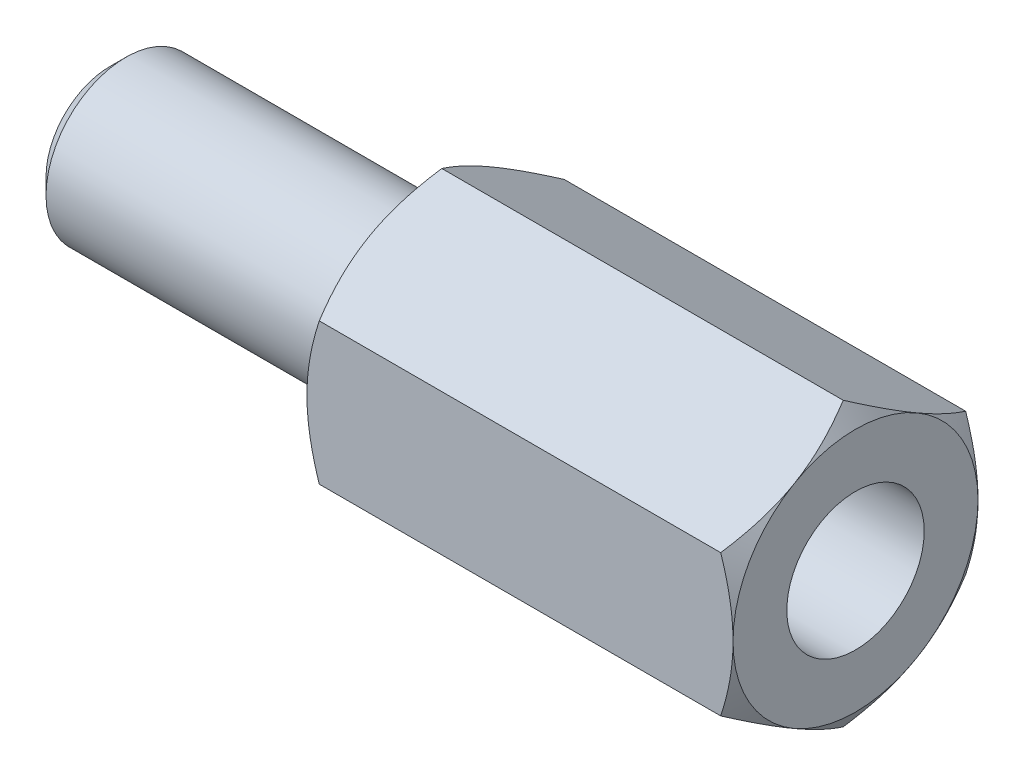
ISO-10303-21;
HEADER;
FILE_DESCRIPTION(('STEP AP214'),'2;1');
FILE_NAME('part.step','',(''),(''),'','','');
FILE_SCHEMA(('AUTOMOTIVE_DESIGN { 1 0 10303 214 1 1 1 1 }'));
ENDSEC;
DATA;
#1=APPLICATION_CONTEXT('core data for automotive mechanical design processes');
#2=APPLICATION_PROTOCOL_DEFINITION('international standard','automotive_design',2000,#1);
#3=PRODUCT_CONTEXT('',#1,'mechanical');
#4=PRODUCT('Part','Part','',(#3));
#5=PRODUCT_RELATED_PRODUCT_CATEGORY('part','',(#4));
#6=PRODUCT_DEFINITION_FORMATION('','',#4);
#7=PRODUCT_DEFINITION_CONTEXT('part definition',#1,'design');
#8=PRODUCT_DEFINITION('design','',#6,#7);
#9=PRODUCT_DEFINITION_SHAPE('','',#8);
#10=(LENGTH_UNIT() NAMED_UNIT(*) SI_UNIT(.MILLI.,.METRE.));
#11=(NAMED_UNIT(*) PLANE_ANGLE_UNIT() SI_UNIT($,.RADIAN.));
#12=(NAMED_UNIT(*) SI_UNIT($,.STERADIAN.) SOLID_ANGLE_UNIT());
#13=UNCERTAINTY_MEASURE_WITH_UNIT(LENGTH_MEASURE(1.E-05),#10,'distance_accuracy_value','');
#14=(GEOMETRIC_REPRESENTATION_CONTEXT(3) GLOBAL_UNCERTAINTY_ASSIGNED_CONTEXT((#13)) GLOBAL_UNIT_ASSIGNED_CONTEXT((#10,
#11,#12)) REPRESENTATION_CONTEXT('',''));
#15=CARTESIAN_POINT('',(0.,0.,0.));
#16=DIRECTION('',(0.,0.,1.));
#17=DIRECTION('',(1.,0.,0.));
#18=AXIS2_PLACEMENT_3D('',#15,#16,#17);
#19=CARTESIAN_POINT('',(14.,1.32790561913614,-2.3));
#20=DIRECTION('',(0.,-0.866025403784439,0.5));
#21=DIRECTION('',(0.,-0.5,-0.866025403784439));
#22=AXIS2_PLACEMENT_3D('',#19,#20,#21);
#23=PLANE('',#22);
#24=CARTESIAN_POINT('',(6.23114151189903,2.65592670832612,0.00019999999999939));
#25=CARTESIAN_POINT('',(6.19280529166582,2.59691366397619,-0.102013591123392));
#26=CARTESIAN_POINT('',(6.15788766232366,2.53725620375695,-0.205343343273629));
#27=CARTESIAN_POINT('',(6.09699087829287,2.41662067178499,-0.414290213847163));
#28=CARTESIAN_POINT('',(6.0710407846175,2.35563897469395,-0.519913611540628));
#29=CARTESIAN_POINT('',(6.03109182721771,2.23463330972118,-0.72950157127711));
#30=CARTESIAN_POINT('',(6.01674344849799,2.17463934796522,-0.833414161185785));
#31=CARTESIAN_POINT('',(6.00019012206238,2.05431916024773,-1.04181483948871));
#32=CARTESIAN_POINT('',(5.99796500163448,1.99399365354472,-1.14630168209065));
#33=CARTESIAN_POINT('',(6.00522880175094,1.88294362999616,-1.33864596505849));
#34=CARTESIAN_POINT('',(6.01294684621271,1.83218746528761,-1.42655822113102));
#35=CARTESIAN_POINT('',(6.0365520344793,1.73109854203754,-1.60164937228258));
#36=CARTESIAN_POINT('',(6.05244893047322,1.68076636202344,-1.6888272653227));
#37=CARTESIAN_POINT('',(6.09186773641299,1.5794360509366,-1.86433651247186));
#38=CARTESIAN_POINT('',(6.11558727119428,1.52845765714816,-1.9526336806017));
#39=CARTESIAN_POINT('',(6.16912455996599,1.42743944967399,-2.12760234843648));
#40=CARTESIAN_POINT('',(6.19892672049603,1.37739758625026,-2.21427739839182));
#41=CARTESIAN_POINT('',(6.23114151189903,1.3277901490823,-2.3002));
#42=B_SPLINE_CURVE_WITH_KNOTS('',3,(#24,#25,#26,#27,#28,#29,#30,#31,#32,#33,#34,#35,#36,#37,#38,
#39,#40,#41),.UNSPECIFIED.,.F.,.F.,(4,2,2,2,2,2,2,2,4),(0.,0.372495415358142,0.746186895291046,
1.10815054025611,1.46951170498925,1.77457803763789,2.08000896710876,2.39383739121041,
2.70687116627133),.UNSPECIFIED.);
#43=CARTESIAN_POINT('',(6.23106651987903,2.65581123827228,0.));
#44=VERTEX_POINT('',#43);
#45=CARTESIAN_POINT('',(6.,1.99185842870421,-1.15));
#46=VERTEX_POINT('',#45);
#47=EDGE_CURVE('E57',#44,#46,#42,.T.);
#48=ORIENTED_EDGE('',*,*,#47,.F.);
#49=DIRECTION('',(-1.,0.,0.));
#50=VECTOR('',#49,1.);
#51=CARTESIAN_POINT('',(14.,2.65581123827228,0.));
#52=LINE('',#51,#50);
#53=CARTESIAN_POINT('',(13.768933480121,2.65581123827228,0.));
#54=VERTEX_POINT('',#53);
#55=EDGE_CURVE('E185',#54,#44,#52,.T.);
#56=ORIENTED_EDGE('',*,*,#55,.F.);
#57=CARTESIAN_POINT('',(13.768858488101,1.3277901490823,-2.3002));
#58=CARTESIAN_POINT('',(13.8071947083342,1.38680319343223,-2.19798640887661));
#59=CARTESIAN_POINT('',(13.8421123376763,1.44646065365147,-2.09465665672637));
#60=CARTESIAN_POINT('',(13.9030091217071,1.56709618562343,-1.88570978615284));
#61=CARTESIAN_POINT('',(13.9289592153825,1.62807788271447,-1.78008638845937));
#62=CARTESIAN_POINT('',(13.9689081727823,1.74908354768723,-1.57049842872289));
#63=CARTESIAN_POINT('',(13.983256551502,1.8090775094432,-1.46658583881422));
#64=CARTESIAN_POINT('',(13.9998098779376,1.92939769716069,-1.25818516051129));
#65=CARTESIAN_POINT('',(14.0020349983655,1.9897232038637,-1.15369831790935));
#66=CARTESIAN_POINT('',(13.9947711982491,2.10077322741226,-0.961354034941513));
#67=CARTESIAN_POINT('',(13.9870531537873,2.15152939212081,-0.873441778868978));
#68=CARTESIAN_POINT('',(13.9634479655207,2.25261831537088,-0.698350627717423));
#69=CARTESIAN_POINT('',(13.9475510695268,2.30295049538498,-0.611172734677299));
#70=CARTESIAN_POINT('',(13.908132263587,2.40428080647181,-0.435663487528143));
#71=CARTESIAN_POINT('',(13.8844127288057,2.45525920026026,-0.347366319398302));
#72=CARTESIAN_POINT('',(13.830875440034,2.55627740773442,-0.172397651563515));
#73=CARTESIAN_POINT('',(13.801073279504,2.60631927115816,-0.0857226016081787));
#74=CARTESIAN_POINT('',(13.768858488101,2.65592670832612,0.000199999999999665));
#75=B_SPLINE_CURVE_WITH_KNOTS('',3,(#57,#58,#59,#60,#61,#62,#63,#64,#65,#66,#67,#68,#69,#70,#71,
#72,#73,#74),.UNSPECIFIED.,.F.,.F.,(4,2,2,2,2,2,2,2,4),(0.,0.372495415358142,0.746186895291045,
1.10815054025611,1.46951170498925,1.77457803763789,2.08000896710876,2.39383739121041,
2.70687116627133),.UNSPECIFIED.);
#76=CARTESIAN_POINT('',(14.,1.99185842870421,-1.15));
#77=VERTEX_POINT('',#76);
#78=EDGE_CURVE('E305',#77,#54,#75,.T.);
#79=ORIENTED_EDGE('',*,*,#78,.F.);
#80=CARTESIAN_POINT('',(13.768933480121,1.32790561913614,-2.3));
#81=VERTEX_POINT('',#80);
#82=EDGE_CURVE('E419',#81,#77,#75,.T.);
#83=ORIENTED_EDGE('',*,*,#82,.F.);
#84=DIRECTION('',(-1.,0.,0.));
#85=VECTOR('',#84,1.);
#86=CARTESIAN_POINT('',(14.,1.32790561913614,-2.3));
#87=LINE('',#86,#85);
#88=CARTESIAN_POINT('',(6.23106651987903,1.32790561913614,-2.3));
#89=VERTEX_POINT('',#88);
#90=EDGE_CURVE('E166',#81,#89,#87,.T.);
#91=ORIENTED_EDGE('',*,*,#90,.T.);
#92=EDGE_CURVE('E157',#46,#89,#42,.T.);
#93=ORIENTED_EDGE('',*,*,#92,.F.);
#94=EDGE_LOOP('',(#48,#56,#79,#83,#91,#93));
#95=FACE_BOUND('',#94,.T.);
#96=ADVANCED_FACE('F40',(#95),#23,.F.);
#97=CARTESIAN_POINT('',(14.,2.65581123827228,0.));
#98=DIRECTION('',(0.,-0.866025403784439,-0.5));
#99=DIRECTION('',(0.,0.5,-0.866025403784439));
#100=AXIS2_PLACEMENT_3D('',#97,#98,#99);
#101=PLANE('',#100);
#102=CARTESIAN_POINT('',(6.23114151189903,1.3277901490823,2.3002));
#103=CARTESIAN_POINT('',(6.19280529166582,1.38680319343223,2.19798640887661));
#104=CARTESIAN_POINT('',(6.15788766232366,1.44646065365147,2.09465665672637));
#105=CARTESIAN_POINT('',(6.09699087829286,1.56709618562343,1.88570978615284));
#106=CARTESIAN_POINT('',(6.0710407846175,1.62807788271447,1.78008638845937));
#107=CARTESIAN_POINT('',(6.03109182721771,1.74908354768723,1.57049842872289));
#108=CARTESIAN_POINT('',(6.01674344849799,1.8090775094432,1.46658583881422));
#109=CARTESIAN_POINT('',(6.00019012206237,1.92939769716069,1.25818516051129));
#110=CARTESIAN_POINT('',(5.99796500163448,1.9897232038637,1.15369831790935));
#111=CARTESIAN_POINT('',(6.00522880175094,2.10077322741226,0.961354034941513));
#112=CARTESIAN_POINT('',(6.01294684621271,2.15152939212081,0.873441778868978));
#113=CARTESIAN_POINT('',(6.0365520344793,2.25261831537088,0.698350627717423));
#114=CARTESIAN_POINT('',(6.05244893047322,2.30295049538498,0.611172734677299));
#115=CARTESIAN_POINT('',(6.09186773641299,2.40428080647181,0.435663487528143));
#116=CARTESIAN_POINT('',(6.11558727119428,2.45525920026026,0.347366319398302));
#117=CARTESIAN_POINT('',(6.16912455996599,2.55627740773442,0.172397651563515));
#118=CARTESIAN_POINT('',(6.19892672049603,2.60631927115816,0.0857226016081783));
#119=CARTESIAN_POINT('',(6.23114151189903,2.65592670832612,-0.0002000000000004));
#120=B_SPLINE_CURVE_WITH_KNOTS('',3,(#102,#103,#104,#105,#106,#107,#108,#109,#110,#111,#112,
#113,#114,#115,#116,#117,#118,#119),.UNSPECIFIED.,.F.,.F.,(4,2,2,2,2,2,2,2,4),(0.,
0.372495415358143,0.746186895291046,1.10815054025611,1.46951170498925,1.77457803763789,
2.08000896710876,2.39383739121041,2.70687116627134),.UNSPECIFIED.);
#121=CARTESIAN_POINT('',(6.23106651987903,1.32790561913614,2.3));
#122=VERTEX_POINT('',#121);
#123=CARTESIAN_POINT('',(6.,1.99185842870421,1.15));
#124=VERTEX_POINT('',#123);
#125=EDGE_CURVE('E64',#122,#124,#120,.T.);
#126=ORIENTED_EDGE('',*,*,#125,.F.);
#127=DIRECTION('',(-1.,0.,0.));
#128=VECTOR('',#127,1.);
#129=CARTESIAN_POINT('',(14.,1.32790561913614,2.3));
#130=LINE('',#129,#128);
#131=CARTESIAN_POINT('',(13.768933480121,1.32790561913614,2.3));
#132=VERTEX_POINT('',#131);
#133=EDGE_CURVE('E181',#132,#122,#130,.T.);
#134=ORIENTED_EDGE('',*,*,#133,.F.);
#135=CARTESIAN_POINT('',(13.768858488101,2.65592670832612,-0.000200000000000705));
#136=CARTESIAN_POINT('',(13.8071947083342,2.59691366397619,0.10201359112339));
#137=CARTESIAN_POINT('',(13.8421123376763,2.53725620375695,0.205343343273628));
#138=CARTESIAN_POINT('',(13.9030091217071,2.41662067178499,0.414290213847162));
#139=CARTESIAN_POINT('',(13.9289592153825,2.35563897469395,0.519913611540627));
#140=CARTESIAN_POINT('',(13.9689081727823,2.23463330972119,0.729501571277108));
#141=CARTESIAN_POINT('',(13.983256551502,2.17463934796522,0.833414161185783));
#142=CARTESIAN_POINT('',(13.9998098779376,2.05431916024773,1.04181483948871));
#143=CARTESIAN_POINT('',(14.0020349983655,1.99399365354472,1.14630168209065));
#144=CARTESIAN_POINT('',(13.9947711982491,1.88294362999616,1.33864596505849));
#145=CARTESIAN_POINT('',(13.9870531537873,1.83218746528761,1.42655822113102));
#146=CARTESIAN_POINT('',(13.9634479655207,1.73109854203754,1.60164937228258));
#147=CARTESIAN_POINT('',(13.9475510695268,1.68076636202344,1.6888272653227));
#148=CARTESIAN_POINT('',(13.908132263587,1.5794360509366,1.86433651247186));
#149=CARTESIAN_POINT('',(13.8844127288057,1.52845765714816,1.9526336806017));
#150=CARTESIAN_POINT('',(13.830875440034,1.42743944967399,2.12760234843648));
#151=CARTESIAN_POINT('',(13.801073279504,1.37739758625026,2.21427739839182));
#152=CARTESIAN_POINT('',(13.768858488101,1.3277901490823,2.3002));
#153=B_SPLINE_CURVE_WITH_KNOTS('',3,(#135,#136,#137,#138,#139,#140,#141,#142,#143,#144,#145,
#146,#147,#148,#149,#150,#151,#152),.UNSPECIFIED.,.F.,.F.,(4,2,2,2,2,2,2,2,4),(0.,
0.372495415358142,0.746186895291045,1.10815054025611,1.46951170498925,1.77457803763789,
2.08000896710876,2.39383739121041,2.70687116627134),.UNSPECIFIED.);
#154=CARTESIAN_POINT('',(14.,1.99185842870421,1.15));
#155=VERTEX_POINT('',#154);
#156=EDGE_CURVE('E296',#155,#132,#153,.T.);
#157=ORIENTED_EDGE('',*,*,#156,.F.);
#158=EDGE_CURVE('E303',#54,#155,#153,.T.);
#159=ORIENTED_EDGE('',*,*,#158,.F.);
#160=ORIENTED_EDGE('',*,*,#55,.T.);
#161=EDGE_CURVE('E322',#124,#44,#120,.T.);
#162=ORIENTED_EDGE('',*,*,#161,.F.);
#163=EDGE_LOOP('',(#126,#134,#157,#159,#160,#162));
#164=FACE_BOUND('',#163,.T.);
#165=ADVANCED_FACE('F312',(#164),#101,.F.);
#166=CARTESIAN_POINT('',(14.,1.32790561913614,2.3));
#167=DIRECTION('',(0.,0.,-1.));
#168=DIRECTION('',(-1.,0.,0.));
#169=AXIS2_PLACEMENT_3D('',#166,#167,#168);
#170=PLANE('',#169);
#171=CARTESIAN_POINT('',(7.18303327864269,-3.42030783160288,2.3));
#172=CARTESIAN_POINT('',(7.1321404948453,-3.32584338319353,2.3));
#173=CARTESIAN_POINT('',(7.08173425774497,-3.23111223233854,2.3));
#174=CARTESIAN_POINT('',(6.98216059123448,-3.04097999487793,2.3));
#175=CARTESIAN_POINT('',(6.93299338744914,-2.9455787902442,2.3));
#176=CARTESIAN_POINT('',(6.83588242210247,-2.75341096258753,2.3));
#177=CARTESIAN_POINT('',(6.78794811945419,-2.65663954283474,2.3));
#178=CARTESIAN_POINT('',(6.69401190604033,-2.46216658469587,2.3));
#179=CARTESIAN_POINT('',(6.6480098923948,-2.36446509616959,2.3));
#180=CARTESIAN_POINT('',(6.55676718158655,-2.16428050408746,2.3));
#181=CARTESIAN_POINT('',(6.51161895417136,-2.06175501956546,2.3));
#182=CARTESIAN_POINT('',(6.42468056875924,-1.8552646522458,2.3));
#183=CARTESIAN_POINT('',(6.38289083591838,-1.75129958915683,2.3));
#184=CARTESIAN_POINT('',(6.30375266900605,-1.54194750228997,2.3));
#185=CARTESIAN_POINT('',(6.26639429776416,-1.43656427364031,2.3));
#186=CARTESIAN_POINT('',(6.19728099263094,-1.22399350109623,2.3));
#187=CARTESIAN_POINT('',(6.16552408875659,-1.11680660611987,2.3));
#188=CARTESIAN_POINT('',(6.10778269918085,-0.895408884118111,2.3));
#189=CARTESIAN_POINT('',(6.08214346922818,-0.781106050706559,2.3));
#190=CARTESIAN_POINT('',(6.04054521215178,-0.550732196771112,2.3));
#191=CARTESIAN_POINT('',(6.02458395622617,-0.434661589675852,2.3));
#192=CARTESIAN_POINT('',(6.00400904827015,-0.203313901358985,2.3));
#193=CARTESIAN_POINT('',(5.99922219331011,-0.0880527049289574,2.3));
#194=CARTESIAN_POINT('',(6.00098619466147,0.14238765912966,2.3));
#195=CARTESIAN_POINT('',(6.00753818804377,0.257566817372611,2.3));
#196=CARTESIAN_POINT('',(6.03399455188254,0.512574782528764,2.3));
#197=CARTESIAN_POINT('',(6.05657021100428,0.652122213707216,2.3));
#198=CARTESIAN_POINT('',(6.11486053491366,0.928480071696349,2.3));
#199=CARTESIAN_POINT('',(6.15058789324207,1.06528771921453,2.3));
#200=CARTESIAN_POINT('',(6.21205384385533,1.26982039301699,2.3));
#201=CARTESIAN_POINT('',(6.23415895632612,1.33867848724306,2.3));
#202=CARTESIAN_POINT('',(6.28056657336378,1.47560987436602,2.3));
#203=CARTESIAN_POINT('',(6.3048678455193,1.5436835835458,2.3));
#204=CARTESIAN_POINT('',(6.35533733495519,1.67912527328069,2.3));
#205=CARTESIAN_POINT('',(6.38150542327363,1.74649330221703,2.3));
#206=CARTESIAN_POINT('',(6.43542964546163,1.8806004227156,2.3));
#207=CARTESIAN_POINT('',(6.46318601853407,1.94733941777032,2.3));
#208=CARTESIAN_POINT('',(6.53408452793011,2.11307507120337,2.3));
#209=CARTESIAN_POINT('',(6.57805286386828,2.2117180226973,2.3));
#210=CARTESIAN_POINT('',(6.66834555154003,2.40792267533292,2.3));
#211=CARTESIAN_POINT('',(6.71467011054109,2.50548428043035,2.3));
#212=CARTESIAN_POINT('',(6.85644286447474,2.79685928074956,2.3));
#213=CARTESIAN_POINT('',(6.95467053055366,2.98931832653304,2.3));
#214=CARTESIAN_POINT('',(7.15605309376747,3.37197876623115,2.3));
#215=CARTESIAN_POINT('',(7.25921518609194,3.56217632511064,2.3));
#216=CARTESIAN_POINT('',(7.46881762362887,3.94076432359893,2.3));
#217=CARTESIAN_POINT('',(7.57525814068571,4.1291546677983,2.3));
#218=CARTESIAN_POINT('',(7.78017756731166,4.48668897901717,2.3));
#219=CARTESIAN_POINT('',(7.87844668339502,4.65595367001293,2.3));
#220=CARTESIAN_POINT('',(8.07641128531736,4.99365625102697,2.3));
#221=CARTESIAN_POINT('',(8.17610683572957,5.16209410314856,2.3));
#222=CARTESIAN_POINT('',(8.37623148485575,5.4977267896045,2.3));
#223=CARTESIAN_POINT('',(8.47665675103161,5.66492391293493,2.3));
#224=CARTESIAN_POINT('',(8.67835916998006,5.99878717277001,2.3));
#225=CARTESIAN_POINT('',(8.77963626024932,6.16545334701733,2.3));
#226=CARTESIAN_POINT('',(8.88123264313394,6.33192315510402,2.3));
#227=B_SPLINE_CURVE_WITH_KNOTS('',3,(#171,#172,#173,#174,#175,#176,#177,#178,#179,#180,#181,
#182,#183,#184,#185,#186,#187,#188,#189,#190,#191,#192,#193,#194,#195,#196,#197,#198,#199,#200,
#201,#202,#203,#204,#205,#206,#207,#208,#209,#210,#211,#212,#213,#214,#215,#216,#217,#218,#219,
#220,#221,#222,#223,#224,#225,#226),.UNSPECIFIED.,.F.,.F.,(4,2,2,2,2,2,2,2,2,2,2,2,2,2,2,2,2,2,
2,2,2,2,2,2,2,2,2,4),(0.,0.321909015735127,0.643876232796546,0.967836762609239,1.29178002202603,
1.62781181071298,1.96388607130228,2.29919184899568,2.63437946667137,2.98546615740115,
3.33647196341553,3.68199998760644,4.02756266369631,4.45083371629972,4.874514370428,
5.09144326512395,5.30825117365043,5.52504411929786,5.74186980131834,6.06582201521799,
6.3898027753441,7.03791016082964,7.68699325507873,8.33611043025459,8.9232703672077,
9.5104569689248,10.0955704684849,10.6806414030129),.UNSPECIFIED.);
#228=CARTESIAN_POINT('',(6.23106651987903,-1.32790561913614,2.3));
#229=VERTEX_POINT('',#228);
#230=CARTESIAN_POINT('',(6.,0.,2.3));
#231=VERTEX_POINT('',#230);
#232=EDGE_CURVE('E342',#229,#231,#227,.T.);
#233=ORIENTED_EDGE('',*,*,#232,.F.);
#234=DIRECTION('',(-1.,0.,0.));
#235=VECTOR('',#234,1.);
#236=CARTESIAN_POINT('',(14.,-1.32790561913614,2.3));
#237=LINE('',#236,#235);
#238=CARTESIAN_POINT('',(13.768933480121,-1.32790561913614,2.3));
#239=VERTEX_POINT('',#238);
#240=EDGE_CURVE('E170',#239,#229,#237,.T.);
#241=ORIENTED_EDGE('',*,*,#240,.F.);
#242=CARTESIAN_POINT('',(12.8169667213573,-3.42030783160288,2.3));
#243=CARTESIAN_POINT('',(12.8678595051547,-3.32584338319353,2.3));
#244=CARTESIAN_POINT('',(12.918265742255,-3.23111223233854,2.3));
#245=CARTESIAN_POINT('',(13.0178394087655,-3.04097999487793,2.3));
#246=CARTESIAN_POINT('',(13.0670066125509,-2.9455787902442,2.3));
#247=CARTESIAN_POINT('',(13.1641175778975,-2.75341096258753,2.3));
#248=CARTESIAN_POINT('',(13.2120518805458,-2.65663954283475,2.3));
#249=CARTESIAN_POINT('',(13.3059880939597,-2.46216658469587,2.3));
#250=CARTESIAN_POINT('',(13.3519901076052,-2.36446509616959,2.3));
#251=CARTESIAN_POINT('',(13.4432328184134,-2.16428050408746,2.3));
#252=CARTESIAN_POINT('',(13.4883810458286,-2.06175501956546,2.3));
#253=CARTESIAN_POINT('',(13.5753194312408,-1.8552646522458,2.3));
#254=CARTESIAN_POINT('',(13.6171091640816,-1.75129958915683,2.3));
#255=CARTESIAN_POINT('',(13.696247330994,-1.54194750228997,2.3));
#256=CARTESIAN_POINT('',(13.7336057022358,-1.43656427364031,2.3));
#257=CARTESIAN_POINT('',(13.8027190073691,-1.22399350109623,2.3));
#258=CARTESIAN_POINT('',(13.8344759112434,-1.11680660611987,2.3));
#259=CARTESIAN_POINT('',(13.8922173008192,-0.89540888411811,2.3));
#260=CARTESIAN_POINT('',(13.9178565307718,-0.781106050706558,2.3));
#261=CARTESIAN_POINT('',(13.9594547878482,-0.550732196771111,2.3));
#262=CARTESIAN_POINT('',(13.9754160437738,-0.434661589675851,2.3));
#263=CARTESIAN_POINT('',(13.9959909517299,-0.203313901358985,2.3));
#264=CARTESIAN_POINT('',(14.0007778066899,-0.0880527049289572,2.3));
#265=CARTESIAN_POINT('',(13.9990138053385,0.14238765912966,2.3));
#266=CARTESIAN_POINT('',(13.9924618119562,0.257566817372611,2.3));
#267=CARTESIAN_POINT('',(13.9660054481175,0.512574782528765,2.3));
#268=CARTESIAN_POINT('',(13.9434297889957,0.652122213707217,2.3));
#269=CARTESIAN_POINT('',(13.8851394650863,0.92848007169635,2.3));
#270=CARTESIAN_POINT('',(13.8494121067579,1.06528771921454,2.3));
#271=CARTESIAN_POINT('',(13.7879461561447,1.269820393017,2.3));
#272=CARTESIAN_POINT('',(13.7658410436739,1.33867848724306,2.3));
#273=CARTESIAN_POINT('',(13.7194334266362,1.47560987436602,2.3));
#274=CARTESIAN_POINT('',(13.6951321544807,1.54368358354581,2.3));
#275=CARTESIAN_POINT('',(13.6446626650448,1.67912527328069,2.3));
#276=CARTESIAN_POINT('',(13.6184945767264,1.74649330221704,2.3));
#277=CARTESIAN_POINT('',(13.5645703545384,1.8806004227156,2.3));
#278=CARTESIAN_POINT('',(13.5368139814659,1.94733941777032,2.3));
#279=CARTESIAN_POINT('',(13.4659154720699,2.11307507120337,2.3));
#280=CARTESIAN_POINT('',(13.4219471361317,2.2117180226973,2.3));
#281=CARTESIAN_POINT('',(13.33165444846,2.40792267533292,2.3));
#282=CARTESIAN_POINT('',(13.2853298894589,2.50548428043035,2.3));
#283=CARTESIAN_POINT('',(13.1435571355253,2.79685928074956,2.3));
#284=CARTESIAN_POINT('',(13.0453294694463,2.98931832653304,2.3));
#285=CARTESIAN_POINT('',(12.8439469062325,3.37197876623115,2.3));
#286=CARTESIAN_POINT('',(12.7407848139081,3.56217632511064,2.3));
#287=CARTESIAN_POINT('',(12.5311823763711,3.94076432359893,2.3));
#288=CARTESIAN_POINT('',(12.4247418593143,4.1291546677983,2.3));
#289=CARTESIAN_POINT('',(12.2198224326883,4.48668897901717,2.3));
#290=CARTESIAN_POINT('',(12.121553316605,4.65595367001292,2.3));
#291=CARTESIAN_POINT('',(11.9235887146826,4.99365625102697,2.3));
#292=CARTESIAN_POINT('',(11.8238931642704,5.16209410314856,2.3));
#293=CARTESIAN_POINT('',(11.6237685151443,5.4977267896045,2.3));
#294=CARTESIAN_POINT('',(11.5233432489684,5.66492391293493,2.3));
#295=CARTESIAN_POINT('',(11.3216408300199,5.99878717277001,2.3));
#296=CARTESIAN_POINT('',(11.2203637397507,6.16545334701733,2.3));
#297=CARTESIAN_POINT('',(11.1187673568661,6.33192315510402,2.3));
#298=B_SPLINE_CURVE_WITH_KNOTS('',3,(#242,#243,#244,#245,#246,#247,#248,#249,#250,#251,#252,
#253,#254,#255,#256,#257,#258,#259,#260,#261,#262,#263,#264,#265,#266,#267,#268,#269,#270,#271,
#272,#273,#274,#275,#276,#277,#278,#279,#280,#281,#282,#283,#284,#285,#286,#287,#288,#289,#290,
#291,#292,#293,#294,#295,#296,#297),.UNSPECIFIED.,.F.,.F.,(4,2,2,2,2,2,2,2,2,2,2,2,2,2,2,2,2,2,
2,2,2,2,2,2,2,2,2,4),(0.,0.321909015735128,0.643876232796547,0.967836762609238,1.29178002202603,
1.62781181071298,1.96388607130228,2.29919184899568,2.63437946667137,2.98546615740115,
3.33647196341553,3.68199998760644,4.02756266369631,4.45083371629972,4.874514370428,
5.09144326512395,5.30825117365043,5.52504411929786,5.74186980131834,6.06582201521799,
6.3898027753441,7.03791016082964,7.68699325507873,8.33611043025459,8.92327036720769,
9.5104569689248,10.0955704684849,10.6806414030129),.UNSPECIFIED.);
#299=CARTESIAN_POINT('',(14.,0.,2.3));
#300=VERTEX_POINT('',#299);
#301=EDGE_CURVE('E248',#300,#239,#298,.F.);
#302=ORIENTED_EDGE('',*,*,#301,.F.);
#303=EDGE_CURVE('E304',#132,#300,#298,.F.);
#304=ORIENTED_EDGE('',*,*,#303,.F.);
#305=ORIENTED_EDGE('',*,*,#133,.T.);
#306=EDGE_CURVE('E336',#231,#122,#227,.T.);
#307=ORIENTED_EDGE('',*,*,#306,.F.);
#308=EDGE_LOOP('',(#233,#241,#302,#304,#305,#307));
#309=FACE_BOUND('',#308,.T.);
#310=ADVANCED_FACE('F315',(#309),#170,.F.);
#311=CARTESIAN_POINT('',(14.,-1.32790561913614,2.3));
#312=DIRECTION('',(0.,0.866025403784439,-0.5));
#313=DIRECTION('',(0.,0.5,0.866025403784438));
#314=AXIS2_PLACEMENT_3D('',#311,#312,#313);
#315=PLANE('',#314);
#316=CARTESIAN_POINT('',(6.23114151189903,-2.65592670832612,-0.000199999999999213));
#317=CARTESIAN_POINT('',(6.19280529166582,-2.59691366397619,0.102013591123392));
#318=CARTESIAN_POINT('',(6.15788766232366,-2.53725620375695,0.205343343273629));
#319=CARTESIAN_POINT('',(6.09699087829287,-2.41662067178499,0.414290213847163));
#320=CARTESIAN_POINT('',(6.0710407846175,-2.35563897469395,0.519913611540628));
#321=CARTESIAN_POINT('',(6.03109182721771,-2.23463330972118,0.72950157127711));
#322=CARTESIAN_POINT('',(6.01674344849799,-2.17463934796522,0.833414161185785));
#323=CARTESIAN_POINT('',(6.00019012206238,-2.05431916024773,1.04181483948871));
#324=CARTESIAN_POINT('',(5.99796500163448,-1.99399365354472,1.14630168209065));
#325=CARTESIAN_POINT('',(6.00522880175094,-1.88294362999615,1.33864596505849));
#326=CARTESIAN_POINT('',(6.01294684621271,-1.83218746528761,1.42655822113102));
#327=CARTESIAN_POINT('',(6.0365520344793,-1.73109854203754,1.60164937228258));
#328=CARTESIAN_POINT('',(6.05244893047322,-1.68076636202344,1.6888272653227));
#329=CARTESIAN_POINT('',(6.09186773641299,-1.5794360509366,1.86433651247186));
#330=CARTESIAN_POINT('',(6.11558727119428,-1.52845765714816,1.9526336806017));
#331=CARTESIAN_POINT('',(6.16912455996599,-1.42743944967399,2.12760234843648));
#332=CARTESIAN_POINT('',(6.19892672049603,-1.37739758625026,2.21427739839182));
#333=CARTESIAN_POINT('',(6.23114151189903,-1.3277901490823,2.3002));
#334=B_SPLINE_CURVE_WITH_KNOTS('',3,(#316,#317,#318,#319,#320,#321,#322,#323,#324,#325,#326,
#327,#328,#329,#330,#331,#332,#333),.UNSPECIFIED.,.F.,.F.,(4,2,2,2,2,2,2,2,4),(0.,
0.372495415358142,0.746186895291046,1.10815054025611,1.46951170498925,1.77457803763789,
2.08000896710876,2.39383739121041,2.70687116627133),.UNSPECIFIED.);
#335=CARTESIAN_POINT('',(6.23106651987903,-2.65581123827228,0.));
#336=VERTEX_POINT('',#335);
#337=CARTESIAN_POINT('',(6.,-1.99185842870421,1.15));
#338=VERTEX_POINT('',#337);
#339=EDGE_CURVE('E330',#336,#338,#334,.T.);
#340=ORIENTED_EDGE('',*,*,#339,.F.);
#341=DIRECTION('',(-1.,0.,0.));
#342=VECTOR('',#341,1.);
#343=CARTESIAN_POINT('',(14.,-2.65581123827228,0.));
#344=LINE('',#343,#342);
#345=CARTESIAN_POINT('',(13.768933480121,-2.65581123827228,0.));
#346=VERTEX_POINT('',#345);
#347=EDGE_CURVE('E165',#346,#336,#344,.T.);
#348=ORIENTED_EDGE('',*,*,#347,.F.);
#349=CARTESIAN_POINT('',(13.768858488101,-1.3277901490823,2.3002));
#350=CARTESIAN_POINT('',(13.8071947083342,-1.38680319343223,2.19798640887661));
#351=CARTESIAN_POINT('',(13.8421123376763,-1.44646065365147,2.09465665672637));
#352=CARTESIAN_POINT('',(13.9030091217071,-1.56709618562343,1.88570978615284));
#353=CARTESIAN_POINT('',(13.9289592153825,-1.62807788271447,1.78008638845937));
#354=CARTESIAN_POINT('',(13.9689081727823,-1.74908354768723,1.57049842872289));
#355=CARTESIAN_POINT('',(13.983256551502,-1.8090775094432,1.46658583881422));
#356=CARTESIAN_POINT('',(13.9998098779376,-1.92939769716069,1.25818516051129));
#357=CARTESIAN_POINT('',(14.0020349983655,-1.9897232038637,1.15369831790935));
#358=CARTESIAN_POINT('',(13.9947711982491,-2.10077322741226,0.961354034941513));
#359=CARTESIAN_POINT('',(13.9870531537873,-2.15152939212081,0.873441778868978));
#360=CARTESIAN_POINT('',(13.9634479655207,-2.25261831537088,0.698350627717423));
#361=CARTESIAN_POINT('',(13.9475510695268,-2.30295049538498,0.6111727346773));
#362=CARTESIAN_POINT('',(13.908132263587,-2.40428080647181,0.435663487528143));
#363=CARTESIAN_POINT('',(13.8844127288057,-2.45525920026026,0.347366319398302));
#364=CARTESIAN_POINT('',(13.830875440034,-2.55627740773442,0.172397651563515));
#365=CARTESIAN_POINT('',(13.801073279504,-2.60631927115816,0.085722601608179));
#366=CARTESIAN_POINT('',(13.768858488101,-2.65592670832612,-0.000199999999999296));
#367=B_SPLINE_CURVE_WITH_KNOTS('',3,(#349,#350,#351,#352,#353,#354,#355,#356,#357,#358,#359,
#360,#361,#362,#363,#364,#365,#366),.UNSPECIFIED.,.F.,.F.,(4,2,2,2,2,2,2,2,4),(0.,
0.372495415358142,0.746186895291046,1.10815054025611,1.46951170498925,1.77457803763789,
2.08000896710876,2.39383739121041,2.70687116627133),.UNSPECIFIED.);
#368=CARTESIAN_POINT('',(14.,-1.99185842870421,1.15));
#369=VERTEX_POINT('',#368);
#370=EDGE_CURVE('E236',#369,#346,#367,.T.);
#371=ORIENTED_EDGE('',*,*,#370,.F.);
#372=EDGE_CURVE('E239',#239,#369,#367,.T.);
#373=ORIENTED_EDGE('',*,*,#372,.F.);
#374=ORIENTED_EDGE('',*,*,#240,.T.);
#375=EDGE_CURVE('E343',#338,#229,#334,.T.);
#376=ORIENTED_EDGE('',*,*,#375,.F.);
#377=EDGE_LOOP('',(#340,#348,#371,#373,#374,#376));
#378=FACE_BOUND('',#377,.T.);
#379=ADVANCED_FACE('F238',(#378),#315,.F.);
#380=CARTESIAN_POINT('',(14.,-2.65581123827228,0.));
#381=DIRECTION('',(0.,0.866025403784439,0.5));
#382=DIRECTION('',(0.,-0.5,0.866025403784439));
#383=AXIS2_PLACEMENT_3D('',#380,#381,#382);
#384=PLANE('',#383);
#385=CARTESIAN_POINT('',(6.23114151189903,-1.3277901490823,-2.3002));
#386=CARTESIAN_POINT('',(6.19280529166582,-1.38680319343223,-2.19798640887661));
#387=CARTESIAN_POINT('',(6.15788766232366,-1.44646065365147,-2.09465665672637));
#388=CARTESIAN_POINT('',(6.09699087829287,-1.56709618562343,-1.88570978615284));
#389=CARTESIAN_POINT('',(6.0710407846175,-1.62807788271447,-1.78008638845937));
#390=CARTESIAN_POINT('',(6.03109182721771,-1.74908354768723,-1.57049842872289));
#391=CARTESIAN_POINT('',(6.01674344849799,-1.8090775094432,-1.46658583881422));
#392=CARTESIAN_POINT('',(6.00019012206238,-1.92939769716069,-1.25818516051129));
#393=CARTESIAN_POINT('',(5.99796500163448,-1.9897232038637,-1.15369831790935));
#394=CARTESIAN_POINT('',(6.00522880175094,-2.10077322741226,-0.961354034941513));
#395=CARTESIAN_POINT('',(6.01294684621271,-2.15152939212081,-0.873441778868978));
#396=CARTESIAN_POINT('',(6.0365520344793,-2.25261831537088,-0.698350627717423));
#397=CARTESIAN_POINT('',(6.05244893047322,-2.30295049538498,-0.611172734677299));
#398=CARTESIAN_POINT('',(6.09186773641299,-2.40428080647181,-0.435663487528143));
#399=CARTESIAN_POINT('',(6.11558727119428,-2.45525920026026,-0.347366319398301));
#400=CARTESIAN_POINT('',(6.16912455996599,-2.55627740773442,-0.172397651563515));
#401=CARTESIAN_POINT('',(6.19892672049603,-2.60631927115816,-0.085722601608178));
#402=CARTESIAN_POINT('',(6.23114151189903,-2.65592670832612,0.000200000000000866));
#403=B_SPLINE_CURVE_WITH_KNOTS('',3,(#385,#386,#387,#388,#389,#390,#391,#392,#393,#394,#395,
#396,#397,#398,#399,#400,#401,#402),.UNSPECIFIED.,.F.,.F.,(4,2,2,2,2,2,2,2,4),(0.,
0.372495415358142,0.746186895291046,1.10815054025611,1.46951170498925,1.77457803763789,
2.08000896710876,2.39383739121041,2.70687116627134),.UNSPECIFIED.);
#404=CARTESIAN_POINT('',(6.23106651987811,-1.32790561913783,-2.3));
#405=VERTEX_POINT('',#404);
#406=CARTESIAN_POINT('',(6.,-1.99185842870421,-1.15));
#407=VERTEX_POINT('',#406);
#408=EDGE_CURVE('E138',#405,#407,#403,.T.);
#409=ORIENTED_EDGE('',*,*,#408,.F.);
#410=DIRECTION('',(-1.,0.,0.));
#411=VECTOR('',#410,1.);
#412=CARTESIAN_POINT('',(14.,-1.32790561913614,-2.3));
#413=LINE('',#412,#411);
#414=CARTESIAN_POINT('',(13.7689334801219,-1.32790561913783,-2.3));
#415=VERTEX_POINT('',#414);
#416=EDGE_CURVE('E153',#415,#405,#413,.T.);
#417=ORIENTED_EDGE('',*,*,#416,.F.);
#418=CARTESIAN_POINT('',(13.768858488101,-2.65592670832612,0.00020000000000089));
#419=CARTESIAN_POINT('',(13.8071947083342,-2.59691366397619,-0.10201359112339));
#420=CARTESIAN_POINT('',(13.8421123376763,-2.53725620375695,-0.205343343273628));
#421=CARTESIAN_POINT('',(13.9030091217071,-2.41662067178499,-0.414290213847162));
#422=CARTESIAN_POINT('',(13.9289592153825,-2.35563897469395,-0.519913611540627));
#423=CARTESIAN_POINT('',(13.9689081727823,-2.23463330972119,-0.729501571277108));
#424=CARTESIAN_POINT('',(13.983256551502,-2.17463934796522,-0.833414161185783));
#425=CARTESIAN_POINT('',(13.9998098779376,-2.05431916024773,-1.04181483948871));
#426=CARTESIAN_POINT('',(14.0020349983655,-1.99399365354472,-1.14630168209065));
#427=CARTESIAN_POINT('',(13.9947711982491,-1.88294362999616,-1.33864596505849));
#428=CARTESIAN_POINT('',(13.9870531537873,-1.83218746528761,-1.42655822113102));
#429=CARTESIAN_POINT('',(13.9634479655207,-1.73109854203754,-1.60164937228258));
#430=CARTESIAN_POINT('',(13.9475510695268,-1.68076636202344,-1.6888272653227));
#431=CARTESIAN_POINT('',(13.908132263587,-1.5794360509366,-1.86433651247186));
#432=CARTESIAN_POINT('',(13.8844127288057,-1.52845765714816,-1.9526336806017));
#433=CARTESIAN_POINT('',(13.830875440034,-1.42743944967399,-2.12760234843648));
#434=CARTESIAN_POINT('',(13.801073279504,-1.37739758625026,-2.21427739839182));
#435=CARTESIAN_POINT('',(13.768858488101,-1.3277901490823,-2.3002));
#436=B_SPLINE_CURVE_WITH_KNOTS('',3,(#418,#419,#420,#421,#422,#423,#424,#425,#426,#427,#428,
#429,#430,#431,#432,#433,#434,#435),.UNSPECIFIED.,.F.,.F.,(4,2,2,2,2,2,2,2,4),(0.,
0.372495415358142,0.746186895291045,1.10815054025611,1.46951170498925,1.77457803763789,
2.08000896710876,2.39383739121041,2.70687116627134),.UNSPECIFIED.);
#437=CARTESIAN_POINT('',(14.,-1.99185842870421,-1.15));
#438=VERTEX_POINT('',#437);
#439=EDGE_CURVE('E249',#438,#415,#436,.T.);
#440=ORIENTED_EDGE('',*,*,#439,.F.);
#441=EDGE_CURVE('E244',#346,#438,#436,.T.);
#442=ORIENTED_EDGE('',*,*,#441,.F.);
#443=ORIENTED_EDGE('',*,*,#347,.T.);
#444=EDGE_CURVE('E155',#407,#336,#403,.T.);
#445=ORIENTED_EDGE('',*,*,#444,.F.);
#446=EDGE_LOOP('',(#409,#417,#440,#442,#443,#445));
#447=FACE_BOUND('',#446,.T.);
#448=ADVANCED_FACE('F151',(#447),#384,.F.);
#449=CARTESIAN_POINT('',(14.,-1.32790561913614,-2.3));
#450=DIRECTION('',(0.,0.,1.));
#451=DIRECTION('',(1.,0.,0.));
#452=AXIS2_PLACEMENT_3D('',#449,#450,#451);
#453=PLANE('',#452);
#454=CARTESIAN_POINT('',(7.18303327864269,-3.42030783160288,-2.3));
#455=CARTESIAN_POINT('',(7.1321404948453,-3.32584338319353,-2.3));
#456=CARTESIAN_POINT('',(7.08173425774497,-3.23111223233854,-2.3));
#457=CARTESIAN_POINT('',(6.98216059123448,-3.04097999487793,-2.3));
#458=CARTESIAN_POINT('',(6.93299338744914,-2.9455787902442,-2.3));
#459=CARTESIAN_POINT('',(6.83588242210247,-2.75341096258753,-2.3));
#460=CARTESIAN_POINT('',(6.78794811945419,-2.65663954283474,-2.3));
#461=CARTESIAN_POINT('',(6.69401190604033,-2.46216658469586,-2.3));
#462=CARTESIAN_POINT('',(6.64800989239479,-2.36446509616959,-2.3));
#463=CARTESIAN_POINT('',(6.55676718158655,-2.16428050408746,-2.3));
#464=CARTESIAN_POINT('',(6.51161895417136,-2.06175501956546,-2.3));
#465=CARTESIAN_POINT('',(6.42468056875924,-1.8552646522458,-2.3));
#466=CARTESIAN_POINT('',(6.38289083591838,-1.75129958915683,-2.3));
#467=CARTESIAN_POINT('',(6.30375266900605,-1.54194750228997,-2.3));
#468=CARTESIAN_POINT('',(6.26639429776416,-1.4365642736403,-2.3));
#469=CARTESIAN_POINT('',(6.19728099263094,-1.22399350109623,-2.3));
#470=CARTESIAN_POINT('',(6.16552408875659,-1.11680660611987,-2.3));
#471=CARTESIAN_POINT('',(6.10778269918085,-0.895408884118111,-2.3));
#472=CARTESIAN_POINT('',(6.08214346922818,-0.781106050706559,-2.3));
#473=CARTESIAN_POINT('',(6.04054521215178,-0.550732196771112,-2.3));
#474=CARTESIAN_POINT('',(6.02458395622617,-0.434661589675852,-2.3));
#475=CARTESIAN_POINT('',(6.00400904827015,-0.203313901358985,-2.3));
#476=CARTESIAN_POINT('',(5.99922219331011,-0.0880527049289579,-2.3));
#477=CARTESIAN_POINT('',(6.00098619466147,0.142387659129659,-2.3));
#478=CARTESIAN_POINT('',(6.00753818804377,0.257566817372611,-2.3));
#479=CARTESIAN_POINT('',(6.03399455188254,0.512574782528764,-2.3));
#480=CARTESIAN_POINT('',(6.05657021100428,0.652122213707216,-2.3));
#481=CARTESIAN_POINT('',(6.11486053491366,0.928480071696349,-2.3));
#482=CARTESIAN_POINT('',(6.15058789324207,1.06528771921453,-2.3));
#483=CARTESIAN_POINT('',(6.21205384385533,1.269820393017,-2.3));
#484=CARTESIAN_POINT('',(6.23415895632612,1.33867848724306,-2.3));
#485=CARTESIAN_POINT('',(6.28056657336378,1.47560987436602,-2.3));
#486=CARTESIAN_POINT('',(6.3048678455193,1.5436835835458,-2.3));
#487=CARTESIAN_POINT('',(6.35533733495519,1.67912527328069,-2.3));
#488=CARTESIAN_POINT('',(6.38150542327363,1.74649330221703,-2.3));
#489=CARTESIAN_POINT('',(6.43542964546163,1.8806004227156,-2.3));
#490=CARTESIAN_POINT('',(6.46318601853407,1.94733941777031,-2.3));
#491=CARTESIAN_POINT('',(6.53408452793011,2.11307507120337,-2.3));
#492=CARTESIAN_POINT('',(6.57805286386828,2.2117180226973,-2.3));
#493=CARTESIAN_POINT('',(6.66834555154003,2.40792267533292,-2.3));
#494=CARTESIAN_POINT('',(6.71467011054109,2.50548428043035,-2.3));
#495=CARTESIAN_POINT('',(6.85644286447474,2.79685928074956,-2.3));
#496=CARTESIAN_POINT('',(6.95467053055366,2.98931832653304,-2.3));
#497=CARTESIAN_POINT('',(7.15605309376747,3.37197876623115,-2.3));
#498=CARTESIAN_POINT('',(7.25921518609194,3.56217632511064,-2.3));
#499=CARTESIAN_POINT('',(7.46881762362886,3.94076432359893,-2.3));
#500=CARTESIAN_POINT('',(7.57525814068571,4.1291546677983,-2.3));
#501=CARTESIAN_POINT('',(7.78017756731166,4.48668897901717,-2.3));
#502=CARTESIAN_POINT('',(7.87844668339502,4.65595367001292,-2.3));
#503=CARTESIAN_POINT('',(8.07641128531736,4.99365625102697,-2.3));
#504=CARTESIAN_POINT('',(8.17610683572957,5.16209410314856,-2.3));
#505=CARTESIAN_POINT('',(8.37623148485574,5.4977267896045,-2.3));
#506=CARTESIAN_POINT('',(8.47665675103161,5.66492391293493,-2.3));
#507=CARTESIAN_POINT('',(8.67835916998007,5.99878717277001,-2.3));
#508=CARTESIAN_POINT('',(8.77963626024932,6.16545334701733,-2.3));
#509=CARTESIAN_POINT('',(8.88123264313394,6.33192315510403,-2.3));
#510=B_SPLINE_CURVE_WITH_KNOTS('',3,(#454,#455,#456,#457,#458,#459,#460,#461,#462,#463,#464,
#465,#466,#467,#468,#469,#470,#471,#472,#473,#474,#475,#476,#477,#478,#479,#480,#481,#482,#483,
#484,#485,#486,#487,#488,#489,#490,#491,#492,#493,#494,#495,#496,#497,#498,#499,#500,#501,#502,
#503,#504,#505,#506,#507,#508,#509),.UNSPECIFIED.,.F.,.F.,(4,2,2,2,2,2,2,2,2,2,2,2,2,2,2,2,2,2,
2,2,2,2,2,2,2,2,2,4),(0.,0.321909015735128,0.643876232796548,0.96783676260924,1.29178002202603,
1.62781181071299,1.96388607130228,2.29919184899568,2.63437946667137,2.98546615740115,
3.33647196341553,3.68199998760644,4.02756266369631,4.45083371629972,4.874514370428,
5.09144326512395,5.30825117365043,5.52504411929786,5.74186980131834,6.06582201521799,
6.3898027753441,7.03791016082964,7.68699325507873,8.33611043025459,8.9232703672077,
9.5104569689248,10.0955704684849,10.6806414030129),.UNSPECIFIED.);
#511=CARTESIAN_POINT('',(6.,0.,-2.3));
#512=VERTEX_POINT('',#511);
#513=EDGE_CURVE('E145',#89,#512,#510,.F.);
#514=ORIENTED_EDGE('',*,*,#513,.F.);
#515=ORIENTED_EDGE('',*,*,#90,.F.);
#516=CARTESIAN_POINT('',(12.8169667213573,-3.42030783160288,-2.3));
#517=CARTESIAN_POINT('',(12.8678595051547,-3.32584338319353,-2.3));
#518=CARTESIAN_POINT('',(12.918265742255,-3.23111223233854,-2.3));
#519=CARTESIAN_POINT('',(13.0178394087655,-3.04097999487793,-2.3));
#520=CARTESIAN_POINT('',(13.0670066125509,-2.9455787902442,-2.3));
#521=CARTESIAN_POINT('',(13.1641175778975,-2.75341096258753,-2.3));
#522=CARTESIAN_POINT('',(13.2120518805458,-2.65663954283475,-2.3));
#523=CARTESIAN_POINT('',(13.3059880939597,-2.46216658469587,-2.3));
#524=CARTESIAN_POINT('',(13.3519901076052,-2.36446509616959,-2.3));
#525=CARTESIAN_POINT('',(13.4432328184134,-2.16428050408746,-2.3));
#526=CARTESIAN_POINT('',(13.4883810458286,-2.06175501956546,-2.3));
#527=CARTESIAN_POINT('',(13.5753194312408,-1.8552646522458,-2.3));
#528=CARTESIAN_POINT('',(13.6171091640816,-1.75129958915683,-2.3));
#529=CARTESIAN_POINT('',(13.696247330994,-1.54194750228997,-2.3));
#530=CARTESIAN_POINT('',(13.7336057022358,-1.43656427364031,-2.3));
#531=CARTESIAN_POINT('',(13.8027190073691,-1.22399350109623,-2.3));
#532=CARTESIAN_POINT('',(13.8344759112434,-1.11680660611987,-2.3));
#533=CARTESIAN_POINT('',(13.8922173008192,-0.895408884118111,-2.3));
#534=CARTESIAN_POINT('',(13.9178565307718,-0.781106050706559,-2.3));
#535=CARTESIAN_POINT('',(13.9594547878482,-0.550732196771112,-2.3));
#536=CARTESIAN_POINT('',(13.9754160437738,-0.434661589675852,-2.3));
#537=CARTESIAN_POINT('',(13.9959909517299,-0.203313901358985,-2.3));
#538=CARTESIAN_POINT('',(14.0007778066899,-0.0880527049289576,-2.3));
#539=CARTESIAN_POINT('',(13.9990138053385,0.14238765912966,-2.3));
#540=CARTESIAN_POINT('',(13.9924618119562,0.257566817372611,-2.3));
#541=CARTESIAN_POINT('',(13.9660054481175,0.512574782528764,-2.3));
#542=CARTESIAN_POINT('',(13.9434297889957,0.652122213707216,-2.3));
#543=CARTESIAN_POINT('',(13.8851394650863,0.92848007169635,-2.3));
#544=CARTESIAN_POINT('',(13.8494121067579,1.06528771921454,-2.3));
#545=CARTESIAN_POINT('',(13.7879461561447,1.269820393017,-2.3));
#546=CARTESIAN_POINT('',(13.7658410436739,1.33867848724306,-2.3));
#547=CARTESIAN_POINT('',(13.7194334266362,1.47560987436602,-2.3));
#548=CARTESIAN_POINT('',(13.6951321544807,1.5436835835458,-2.3));
#549=CARTESIAN_POINT('',(13.6446626650448,1.67912527328069,-2.3));
#550=CARTESIAN_POINT('',(13.6184945767264,1.74649330221704,-2.3));
#551=CARTESIAN_POINT('',(13.5645703545384,1.8806004227156,-2.3));
#552=CARTESIAN_POINT('',(13.5368139814659,1.94733941777032,-2.3));
#553=CARTESIAN_POINT('',(13.4659154720699,2.11307507120337,-2.3));
#554=CARTESIAN_POINT('',(13.4219471361317,2.2117180226973,-2.3));
#555=CARTESIAN_POINT('',(13.33165444846,2.40792267533292,-2.3));
#556=CARTESIAN_POINT('',(13.2853298894589,2.50548428043035,-2.3));
#557=CARTESIAN_POINT('',(13.1435571355253,2.79685928074956,-2.3));
#558=CARTESIAN_POINT('',(13.0453294694463,2.98931832653304,-2.3));
#559=CARTESIAN_POINT('',(12.8439469062325,3.37197876623115,-2.3));
#560=CARTESIAN_POINT('',(12.7407848139081,3.56217632511064,-2.3));
#561=CARTESIAN_POINT('',(12.5311823763711,3.94076432359893,-2.3));
#562=CARTESIAN_POINT('',(12.4247418593143,4.1291546677983,-2.3));
#563=CARTESIAN_POINT('',(12.2198224326883,4.48668897901717,-2.3));
#564=CARTESIAN_POINT('',(12.121553316605,4.65595367001293,-2.3));
#565=CARTESIAN_POINT('',(11.9235887146826,4.99365625102697,-2.3));
#566=CARTESIAN_POINT('',(11.8238931642704,5.16209410314856,-2.3));
#567=CARTESIAN_POINT('',(11.6237685151443,5.4977267896045,-2.3));
#568=CARTESIAN_POINT('',(11.5233432489684,5.66492391293493,-2.3));
#569=CARTESIAN_POINT('',(11.3216408300199,5.99878717277001,-2.3));
#570=CARTESIAN_POINT('',(11.2203637397507,6.16545334701733,-2.3));
#571=CARTESIAN_POINT('',(11.1187673568661,6.33192315510402,-2.3));
#572=B_SPLINE_CURVE_WITH_KNOTS('',3,(#516,#517,#518,#519,#520,#521,#522,#523,#524,#525,#526,
#527,#528,#529,#530,#531,#532,#533,#534,#535,#536,#537,#538,#539,#540,#541,#542,#543,#544,#545,
#546,#547,#548,#549,#550,#551,#552,#553,#554,#555,#556,#557,#558,#559,#560,#561,#562,#563,#564,
#565,#566,#567,#568,#569,#570,#571),.UNSPECIFIED.,.F.,.F.,(4,2,2,2,2,2,2,2,2,2,2,2,2,2,2,2,2,2,
2,2,2,2,2,2,2,2,2,4),(0.,0.321909015735127,0.643876232796547,0.96783676260924,1.29178002202603,
1.62781181071299,1.96388607130228,2.29919184899568,2.63437946667137,2.98546615740116,
3.33647196341554,3.68199998760644,4.02756266369631,4.45083371629972,4.874514370428,
5.09144326512395,5.30825117365043,5.52504411929786,5.74186980131834,6.06582201521799,
6.3898027753441,7.03791016082964,7.68699325507873,8.33611043025459,8.9232703672077,
9.5104569689248,10.0955704684849,10.6806414030129),.UNSPECIFIED.);
#573=CARTESIAN_POINT('',(14.,0.,-2.3));
#574=VERTEX_POINT('',#573);
#575=EDGE_CURVE('E285',#574,#81,#572,.T.);
#576=ORIENTED_EDGE('',*,*,#575,.F.);
#577=EDGE_CURVE('E163',#415,#574,#572,.T.);
#578=ORIENTED_EDGE('',*,*,#577,.F.);
#579=ORIENTED_EDGE('',*,*,#416,.T.);
#580=EDGE_CURVE('E135',#512,#405,#510,.F.);
#581=ORIENTED_EDGE('',*,*,#580,.F.);
#582=EDGE_LOOP('',(#514,#515,#576,#578,#579,#581));
#583=FACE_BOUND('',#582,.T.);
#584=ADVANCED_FACE('F160',(#583),#453,.F.);
#585=CARTESIAN_POINT('',(14.,0.,0.));
#586=DIRECTION('',(-1.,0.,0.));
#587=DIRECTION('',(0.,0.,-1.));
#588=AXIS2_PLACEMENT_3D('',#585,#586,#587);
#589=CONICAL_SURFACE('',#588,2.3,0.99483767363677);
#590=ORIENTED_EDGE('',*,*,#439,.T.);
#591=ORIENTED_EDGE('',*,*,#577,.T.);
#592=CARTESIAN_POINT('',(14.,0.,0.));
#593=DIRECTION('',(1.,0.,0.));
#594=DIRECTION('',(0.,0.,-1.));
#595=AXIS2_PLACEMENT_3D('',#592,#593,#594);
#596=CIRCLE('',#595,2.3);
#597=EDGE_CURVE('E200',#438,#574,#596,.T.);
#598=ORIENTED_EDGE('',*,*,#597,.F.);
#599=EDGE_LOOP('',(#590,#591,#598));
#600=FACE_BOUND('',#599,.T.);
#601=ADVANCED_FACE('F279',(#600),#589,.T.);
#602=ORIENTED_EDGE('',*,*,#370,.T.);
#603=ORIENTED_EDGE('',*,*,#441,.T.);
#604=EDGE_CURVE('E202',#369,#438,#596,.T.);
#605=ORIENTED_EDGE('',*,*,#604,.F.);
#606=EDGE_LOOP('',(#602,#603,#605));
#607=FACE_BOUND('',#606,.T.);
#608=ADVANCED_FACE('F437',(#607),#589,.T.);
#609=ORIENTED_EDGE('',*,*,#301,.T.);
#610=ORIENTED_EDGE('',*,*,#372,.T.);
#611=EDGE_CURVE('E210',#300,#369,#596,.T.);
#612=ORIENTED_EDGE('',*,*,#611,.F.);
#613=EDGE_LOOP('',(#609,#610,#612));
#614=FACE_BOUND('',#613,.T.);
#615=ADVANCED_FACE('F441',(#614),#589,.T.);
#616=ORIENTED_EDGE('',*,*,#156,.T.);
#617=ORIENTED_EDGE('',*,*,#303,.T.);
#618=EDGE_CURVE('E213',#155,#300,#596,.T.);
#619=ORIENTED_EDGE('',*,*,#618,.F.);
#620=EDGE_LOOP('',(#616,#617,#619));
#621=FACE_BOUND('',#620,.T.);
#622=ADVANCED_FACE('F445',(#621),#589,.T.);
#623=ORIENTED_EDGE('',*,*,#78,.T.);
#624=ORIENTED_EDGE('',*,*,#158,.T.);
#625=EDGE_CURVE('E203',#77,#155,#596,.T.);
#626=ORIENTED_EDGE('',*,*,#625,.F.);
#627=EDGE_LOOP('',(#623,#624,#626));
#628=FACE_BOUND('',#627,.T.);
#629=ADVANCED_FACE('F277',(#628),#589,.T.);
#630=ORIENTED_EDGE('',*,*,#82,.T.);
#631=CARTESIAN_POINT('',(14.,0.,0.));
#632=DIRECTION('',(1.,0.,0.));
#633=DIRECTION('',(0.,0.,-1.));
#634=AXIS2_PLACEMENT_3D('',#631,#632,#633);
#635=CIRCLE('',#634,2.3);
#636=EDGE_CURVE('E344',#574,#77,#635,.T.);
#637=ORIENTED_EDGE('',*,*,#636,.F.);
#638=ORIENTED_EDGE('',*,*,#575,.T.);
#639=EDGE_LOOP('',(#630,#637,#638));
#640=FACE_BOUND('',#639,.T.);
#641=ADVANCED_FACE('F271',(#640),#589,.T.);
#642=CARTESIAN_POINT('',(10.,0.,0.));
#643=DIRECTION('',(1.,0.,0.));
#644=DIRECTION('',(0.,0.,-1.));
#645=AXIS2_PLACEMENT_3D('',#642,#643,#644);
#646=CONICAL_SURFACE('',#645,1.29,1.0471975511966);
#647=CARTESIAN_POINT('',(9.25521815274539,0.,0.));
#648=VERTEX_POINT('',#647);
#649=VERTEX_LOOP('',#648);
#650=FACE_BOUND('',#649,.T.);
#651=CARTESIAN_POINT('',(10.,0.,0.));
#652=DIRECTION('',(1.,0.,0.));
#653=DIRECTION('',(0.,0.,-1.));
#654=AXIS2_PLACEMENT_3D('',#651,#652,#653);
#655=CIRCLE('',#654,1.29);
#656=CARTESIAN_POINT('',(10.,0.,-1.29));
#657=VERTEX_POINT('',#656);
#658=EDGE_CURVE('E420',#657,#657,#655,.T.);
#659=ORIENTED_EDGE('',*,*,#658,.T.);
#660=EDGE_LOOP('',(#659));
#661=FACE_BOUND('',#660,.T.);
#662=ADVANCED_FACE('F276',(#650,#661),#646,.F.);
#663=CARTESIAN_POINT('',(10.,0.,0.));
#664=DIRECTION('',(1.,0.,0.));
#665=DIRECTION('',(0.,0.,-1.));
#666=AXIS2_PLACEMENT_3D('',#663,#664,#665);
#667=CYLINDRICAL_SURFACE('',#666,1.29);
#668=ORIENTED_EDGE('',*,*,#658,.F.);
#669=EDGE_LOOP('',(#668));
#670=FACE_BOUND('',#669,.T.);
#671=CARTESIAN_POINT('',(14.,0.,0.));
#672=DIRECTION('',(1.,0.,0.));
#673=DIRECTION('',(0.,0.,-1.));
#674=AXIS2_PLACEMENT_3D('',#671,#672,#673);
#675=CIRCLE('',#674,1.29);
#676=CARTESIAN_POINT('',(14.,0.,-1.29));
#677=VERTEX_POINT('',#676);
#678=EDGE_CURVE('E174',#677,#677,#675,.T.);
#679=ORIENTED_EDGE('',*,*,#678,.T.);
#680=EDGE_LOOP('',(#679));
#681=FACE_BOUND('',#680,.T.);
#682=ADVANCED_FACE('F399',(#670,#681),#667,.F.);
#683=CARTESIAN_POINT('',(14.,0.,0.));
#684=DIRECTION('',(1.,0.,0.));
#685=DIRECTION('',(0.,0.,-1.));
#686=AXIS2_PLACEMENT_3D('',#683,#684,#685);
#687=PLANE('',#686);
#688=ORIENTED_EDGE('',*,*,#678,.F.);
#689=EDGE_LOOP('',(#688));
#690=FACE_BOUND('',#689,.T.);
#691=ORIENTED_EDGE('',*,*,#597,.T.);
#692=ORIENTED_EDGE('',*,*,#636,.T.);
#693=ORIENTED_EDGE('',*,*,#625,.T.);
#694=ORIENTED_EDGE('',*,*,#618,.T.);
#695=ORIENTED_EDGE('',*,*,#611,.T.);
#696=ORIENTED_EDGE('',*,*,#604,.T.);
#697=EDGE_LOOP('',(#691,#692,#693,#694,#695,#696));
#698=FACE_BOUND('',#697,.T.);
#699=ADVANCED_FACE('F230',(#690,#698),#687,.T.);
#700=CARTESIAN_POINT('',(6.,0.,0.));
#701=DIRECTION('',(1.,0.,0.));
#702=DIRECTION('',(0.,0.,1.));
#703=AXIS2_PLACEMENT_3D('',#700,#701,#702);
#704=CONICAL_SURFACE('',#703,2.3,0.99483767363677);
#705=ORIENTED_EDGE('',*,*,#408,.T.);
#706=CARTESIAN_POINT('',(6.,0.,0.));
#707=DIRECTION('',(1.,0.,0.));
#708=DIRECTION('',(0.,0.,-1.));
#709=AXIS2_PLACEMENT_3D('',#706,#707,#708);
#710=CIRCLE('',#709,2.3);
#711=EDGE_CURVE('E44',#407,#512,#710,.T.);
#712=ORIENTED_EDGE('',*,*,#711,.T.);
#713=ORIENTED_EDGE('',*,*,#580,.T.);
#714=EDGE_LOOP('',(#705,#712,#713));
#715=FACE_BOUND('',#714,.T.);
#716=ADVANCED_FACE('F137',(#715),#704,.T.);
#717=ORIENTED_EDGE('',*,*,#339,.T.);
#718=EDGE_CURVE('E220',#338,#407,#710,.T.);
#719=ORIENTED_EDGE('',*,*,#718,.T.);
#720=ORIENTED_EDGE('',*,*,#444,.T.);
#721=EDGE_LOOP('',(#717,#719,#720));
#722=FACE_BOUND('',#721,.T.);
#723=ADVANCED_FACE('F480',(#722),#704,.T.);
#724=ORIENTED_EDGE('',*,*,#232,.T.);
#725=EDGE_CURVE('E353',#231,#338,#710,.T.);
#726=ORIENTED_EDGE('',*,*,#725,.T.);
#727=ORIENTED_EDGE('',*,*,#375,.T.);
#728=EDGE_LOOP('',(#724,#726,#727));
#729=FACE_BOUND('',#728,.T.);
#730=ADVANCED_FACE('F280',(#729),#704,.T.);
#731=ORIENTED_EDGE('',*,*,#306,.T.);
#732=ORIENTED_EDGE('',*,*,#125,.T.);
#733=CARTESIAN_POINT('',(6.,0.,0.));
#734=DIRECTION('',(-1.,0.,0.));
#735=DIRECTION('',(0.,0.,1.));
#736=AXIS2_PLACEMENT_3D('',#733,#734,#735);
#737=CIRCLE('',#736,2.3);
#738=EDGE_CURVE('E146',#231,#124,#737,.T.);
#739=ORIENTED_EDGE('',*,*,#738,.F.);
#740=EDGE_LOOP('',(#731,#732,#739));
#741=FACE_BOUND('',#740,.T.);
#742=ADVANCED_FACE('F359',(#741),#704,.T.);
#743=ORIENTED_EDGE('',*,*,#161,.T.);
#744=ORIENTED_EDGE('',*,*,#47,.T.);
#745=EDGE_CURVE('E50',#46,#124,#710,.T.);
#746=ORIENTED_EDGE('',*,*,#745,.T.);
#747=EDGE_LOOP('',(#743,#744,#746));
#748=FACE_BOUND('',#747,.T.);
#749=ADVANCED_FACE('F429',(#748),#704,.T.);
#750=ORIENTED_EDGE('',*,*,#92,.T.);
#751=ORIENTED_EDGE('',*,*,#513,.T.);
#752=EDGE_CURVE('E11',#512,#46,#710,.T.);
#753=ORIENTED_EDGE('',*,*,#752,.T.);
#754=EDGE_LOOP('',(#750,#751,#753));
#755=FACE_BOUND('',#754,.T.);
#756=ADVANCED_FACE('F431',(#755),#704,.T.);
#757=CARTESIAN_POINT('',(0.,0.,0.));
#758=DIRECTION('',(1.,0.,0.));
#759=DIRECTION('',(0.,0.,-1.));
#760=AXIS2_PLACEMENT_3D('',#757,#758,#759);
#761=PLANE('',#760);
#762=CARTESIAN_POINT('',(0.,0.,0.));
#763=DIRECTION('',(-1.,0.,0.));
#764=DIRECTION('',(0.,0.,1.));
#765=AXIS2_PLACEMENT_3D('',#762,#763,#764);
#766=CIRCLE('',#765,1.2);
#767=CARTESIAN_POINT('',(0.,0.,1.2));
#768=VERTEX_POINT('',#767);
#769=EDGE_CURVE('E197',#768,#768,#766,.T.);
#770=ORIENTED_EDGE('',*,*,#769,.T.);
#771=EDGE_LOOP('',(#770));
#772=FACE_BOUND('',#771,.T.);
#773=ADVANCED_FACE('F42',(#772),#761,.F.);
#774=CARTESIAN_POINT('',(0.299999999999999,0.,0.));
#775=DIRECTION('',(1.,0.,0.));
#776=DIRECTION('',(0.,0.,-1.));
#777=AXIS2_PLACEMENT_3D('',#774,#775,#776);
#778=CONICAL_SURFACE('',#777,1.5,0.78539816339745);
#779=ORIENTED_EDGE('',*,*,#769,.F.);
#780=EDGE_LOOP('',(#779));
#781=FACE_BOUND('',#780,.T.);
#782=CARTESIAN_POINT('',(0.299999999999999,0.,0.));
#783=DIRECTION('',(-1.,0.,0.));
#784=DIRECTION('',(0.,0.,1.));
#785=AXIS2_PLACEMENT_3D('',#782,#783,#784);
#786=CIRCLE('',#785,1.5);
#787=CARTESIAN_POINT('',(0.299999999999999,0.,1.5));
#788=VERTEX_POINT('',#787);
#789=EDGE_CURVE('E193',#788,#788,#786,.T.);
#790=ORIENTED_EDGE('',*,*,#789,.T.);
#791=EDGE_LOOP('',(#790));
#792=FACE_BOUND('',#791,.T.);
#793=ADVANCED_FACE('F519',(#781,#792),#778,.T.);
#794=CARTESIAN_POINT('',(0.,0.,0.));
#795=DIRECTION('',(-1.,0.,0.));
#796=DIRECTION('',(0.,0.,1.));
#797=AXIS2_PLACEMENT_3D('',#794,#795,#796);
#798=CYLINDRICAL_SURFACE('',#797,1.5);
#799=ORIENTED_EDGE('',*,*,#789,.F.);
#800=EDGE_LOOP('',(#799));
#801=FACE_BOUND('',#800,.T.);
#802=CARTESIAN_POINT('',(6.,0.,0.));
#803=DIRECTION('',(1.,0.,0.));
#804=DIRECTION('',(0.,0.,-1.));
#805=AXIS2_PLACEMENT_3D('',#802,#803,#804);
#806=CIRCLE('',#805,1.5);
#807=CARTESIAN_POINT('',(6.,0.,-1.5));
#808=VERTEX_POINT('',#807);
#809=EDGE_CURVE('E189',#808,#808,#806,.T.);
#810=ORIENTED_EDGE('',*,*,#809,.F.);
#811=EDGE_LOOP('',(#810));
#812=FACE_BOUND('',#811,.T.);
#813=ADVANCED_FACE('F396',(#801,#812),#798,.T.);
#814=CARTESIAN_POINT('',(6.,0.,0.));
#815=DIRECTION('',(1.,0.,0.));
#816=DIRECTION('',(0.,0.,-1.));
#817=AXIS2_PLACEMENT_3D('',#814,#815,#816);
#818=PLANE('',#817);
#819=ORIENTED_EDGE('',*,*,#809,.T.);
#820=EDGE_LOOP('',(#819));
#821=FACE_BOUND('',#820,.T.);
#822=ORIENTED_EDGE('',*,*,#752,.F.);
#823=ORIENTED_EDGE('',*,*,#711,.F.);
#824=ORIENTED_EDGE('',*,*,#718,.F.);
#825=ORIENTED_EDGE('',*,*,#725,.F.);
#826=ORIENTED_EDGE('',*,*,#738,.T.);
#827=ORIENTED_EDGE('',*,*,#745,.F.);
#828=EDGE_LOOP('',(#822,#823,#824,#825,#826,#827));
#829=FACE_BOUND('',#828,.T.);
#830=ADVANCED_FACE('F365',(#821,#829),#818,.F.);
#831=CLOSED_SHELL('',(#96,#165,#310,#379,#448,#584,#601,#608,#615,#622,#629,#641,#662,#682,#699,
#716,#723,#730,#742,#749,#756,#773,#793,#813,#830));
#832=MANIFOLD_SOLID_BREP('B2',#831);
#833=ADVANCED_BREP_SHAPE_REPRESENTATION('',(#18,#832),#14);
#834=SHAPE_DEFINITION_REPRESENTATION(#9,#833);
ENDSEC;
END-ISO-10303-21;
